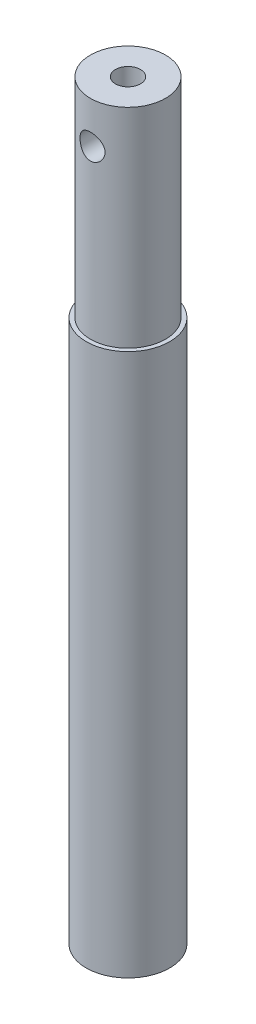
ISO-10303-21;
HEADER;
FILE_DESCRIPTION(('STEP AP214'),'2;1');
FILE_NAME('part.step','',(''),(''),'','','');
FILE_SCHEMA(('AUTOMOTIVE_DESIGN { 1 0 10303 214 1 1 1 1 }'));
ENDSEC;
DATA;
#1=APPLICATION_CONTEXT('core data for automotive mechanical design processes');
#2=APPLICATION_PROTOCOL_DEFINITION('international standard','automotive_design',2000,#1);
#3=PRODUCT_CONTEXT('',#1,'mechanical');
#4=PRODUCT('Part','Part','',(#3));
#5=PRODUCT_RELATED_PRODUCT_CATEGORY('part','',(#4));
#6=PRODUCT_DEFINITION_FORMATION('','',#4);
#7=PRODUCT_DEFINITION_CONTEXT('part definition',#1,'design');
#8=PRODUCT_DEFINITION('design','',#6,#7);
#9=PRODUCT_DEFINITION_SHAPE('','',#8);
#10=(LENGTH_UNIT() NAMED_UNIT(*) SI_UNIT(.MILLI.,.METRE.));
#11=(NAMED_UNIT(*) PLANE_ANGLE_UNIT() SI_UNIT($,.RADIAN.));
#12=(NAMED_UNIT(*) SI_UNIT($,.STERADIAN.) SOLID_ANGLE_UNIT());
#13=UNCERTAINTY_MEASURE_WITH_UNIT(LENGTH_MEASURE(1.E-05),#10,'distance_accuracy_value','');
#14=(GEOMETRIC_REPRESENTATION_CONTEXT(3) GLOBAL_UNCERTAINTY_ASSIGNED_CONTEXT((#13)) GLOBAL_UNIT_ASSIGNED_CONTEXT((#10,
#11,#12)) REPRESENTATION_CONTEXT('',''));
#15=CARTESIAN_POINT('',(0.,0.,0.));
#16=DIRECTION('',(0.,0.,1.));
#17=DIRECTION('',(1.,0.,0.));
#18=AXIS2_PLACEMENT_3D('',#15,#16,#17);
#19=CARTESIAN_POINT('',(0.,90.,0.));
#20=DIRECTION('',(0.,-1.,0.));
#21=DIRECTION('',(0.,0.,-1.));
#22=AXIS2_PLACEMENT_3D('',#19,#20,#21);
#23=CYLINDRICAL_SURFACE('',#22,1.5);
#24=CARTESIAN_POINT('',(0.,85.,0.));
#25=DIRECTION('',(0.,-0.707106781186547,0.707106781186547));
#26=DIRECTION('',(0.,-0.707106781186547,-0.707106781186547));
#27=AXIS2_PLACEMENT_3D('',#24,#25,#26);
#28=ELLIPSE('',#27,2.12132034355964,1.5);
#29=CARTESIAN_POINT('',(-1.5,85.,0.));
#30=VERTEX_POINT('',#29);
#31=CARTESIAN_POINT('',(1.5,85.,0.));
#32=VERTEX_POINT('',#31);
#33=EDGE_CURVE('E11',#30,#32,#28,.F.);
#34=ORIENTED_EDGE('',*,*,#33,.F.);
#35=CARTESIAN_POINT('',(0.,85.,0.));
#36=DIRECTION('',(0.,-0.707106781186547,-0.707106781186547));
#37=DIRECTION('',(0.,-0.707106781186547,0.707106781186547));
#38=AXIS2_PLACEMENT_3D('',#35,#36,#37);
#39=ELLIPSE('',#38,2.12132034355964,1.5);
#40=EDGE_CURVE('E48',#32,#30,#39,.F.);
#41=ORIENTED_EDGE('',*,*,#40,.F.);
#42=EDGE_LOOP('',(#34,#41));
#43=FACE_BOUND('',#42,.T.);
#44=CARTESIAN_POINT('',(0.,90.,0.));
#45=DIRECTION('',(0.,1.,0.));
#46=DIRECTION('',(0.,0.,1.));
#47=AXIS2_PLACEMENT_3D('',#44,#45,#46);
#48=CIRCLE('',#47,1.5);
#49=CARTESIAN_POINT('',(0.,90.,1.5));
#50=VERTEX_POINT('',#49);
#51=EDGE_CURVE('E85',#50,#50,#48,.T.);
#52=ORIENTED_EDGE('',*,*,#51,.T.);
#53=EDGE_LOOP('',(#52));
#54=FACE_BOUND('',#53,.T.);
#55=ADVANCED_FACE('F34',(#43,#54),#23,.F.);
#56=CARTESIAN_POINT('',(0.,65.,0.));
#57=DIRECTION('',(0.,1.,0.));
#58=DIRECTION('',(0.,0.,1.));
#59=AXIS2_PLACEMENT_3D('',#56,#57,#58);
#60=PLANE('',#59);
#61=CARTESIAN_POINT('',(0.,65.,0.));
#62=DIRECTION('',(0.,1.,0.));
#63=DIRECTION('',(0.,0.,1.));
#64=AXIS2_PLACEMENT_3D('',#61,#62,#63);
#65=CIRCLE('',#64,4.5);
#66=CARTESIAN_POINT('',(0.,65.,4.5));
#67=VERTEX_POINT('',#66);
#68=EDGE_CURVE('E62',#67,#67,#65,.T.);
#69=ORIENTED_EDGE('',*,*,#68,.F.);
#70=EDGE_LOOP('',(#69));
#71=FACE_BOUND('',#70,.T.);
#72=CARTESIAN_POINT('',(0.,65.,0.));
#73=DIRECTION('',(0.,1.,0.));
#74=DIRECTION('',(0.,0.,1.));
#75=AXIS2_PLACEMENT_3D('',#72,#73,#74);
#76=CIRCLE('',#75,5.);
#77=CARTESIAN_POINT('',(0.,65.,5.));
#78=VERTEX_POINT('',#77);
#79=EDGE_CURVE('E71',#78,#78,#76,.T.);
#80=ORIENTED_EDGE('',*,*,#79,.T.);
#81=EDGE_LOOP('',(#80));
#82=FACE_BOUND('',#81,.T.);
#83=ADVANCED_FACE('F127',(#71,#82),#60,.T.);
#84=CARTESIAN_POINT('',(0.,0.,0.));
#85=DIRECTION('',(0.,1.,0.));
#86=DIRECTION('',(0.,0.,1.));
#87=AXIS2_PLACEMENT_3D('',#84,#85,#86);
#88=PLANE('',#87);
#89=CARTESIAN_POINT('',(0.,0.,0.));
#90=DIRECTION('',(0.,1.,0.));
#91=DIRECTION('',(0.,0.,1.));
#92=AXIS2_PLACEMENT_3D('',#89,#90,#91);
#93=CIRCLE('',#92,5.);
#94=CARTESIAN_POINT('',(0.,0.,5.));
#95=VERTEX_POINT('',#94);
#96=EDGE_CURVE('E68',#95,#95,#93,.T.);
#97=ORIENTED_EDGE('',*,*,#96,.F.);
#98=EDGE_LOOP('',(#97));
#99=FACE_BOUND('',#98,.T.);
#100=CARTESIAN_POINT('',(0.,0.,0.));
#101=DIRECTION('',(0.,1.,0.));
#102=DIRECTION('',(0.,0.,1.));
#103=AXIS2_PLACEMENT_3D('',#100,#101,#102);
#104=CIRCLE('',#103,2.5);
#105=CARTESIAN_POINT('',(0.,0.,2.5));
#106=VERTEX_POINT('',#105);
#107=EDGE_CURVE('E72',#106,#106,#104,.T.);
#108=ORIENTED_EDGE('',*,*,#107,.T.);
#109=EDGE_LOOP('',(#108));
#110=FACE_BOUND('',#109,.T.);
#111=ADVANCED_FACE('F131',(#99,#110),#88,.F.);
#112=CARTESIAN_POINT('',(0.,65.,0.));
#113=DIRECTION('',(0.,-1.,0.));
#114=DIRECTION('',(0.,0.,-1.));
#115=AXIS2_PLACEMENT_3D('',#112,#113,#114);
#116=CYLINDRICAL_SURFACE('',#115,5.);
#117=ORIENTED_EDGE('',*,*,#79,.F.);
#118=EDGE_LOOP('',(#117));
#119=FACE_BOUND('',#118,.T.);
#120=ORIENTED_EDGE('',*,*,#96,.T.);
#121=EDGE_LOOP('',(#120));
#122=FACE_BOUND('',#121,.T.);
#123=ADVANCED_FACE('F36',(#119,#122),#116,.T.);
#124=CARTESIAN_POINT('',(0.,65.,0.));
#125=DIRECTION('',(0.,-1.,0.));
#126=DIRECTION('',(0.,0.,-1.));
#127=AXIS2_PLACEMENT_3D('',#124,#125,#126);
#128=CYLINDRICAL_SURFACE('',#127,2.5);
#129=CARTESIAN_POINT('',(0.,65.,0.));
#130=DIRECTION('',(0.,1.,0.));
#131=DIRECTION('',(0.,0.,1.));
#132=AXIS2_PLACEMENT_3D('',#129,#130,#131);
#133=CIRCLE('',#132,2.5);
#134=CARTESIAN_POINT('',(0.,65.,2.5));
#135=VERTEX_POINT('',#134);
#136=EDGE_CURVE('E77',#135,#135,#133,.T.);
#137=ORIENTED_EDGE('',*,*,#136,.T.);
#138=EDGE_LOOP('',(#137));
#139=FACE_BOUND('',#138,.T.);
#140=ORIENTED_EDGE('',*,*,#107,.F.);
#141=EDGE_LOOP('',(#140));
#142=FACE_BOUND('',#141,.T.);
#143=ADVANCED_FACE('F116',(#139,#142),#128,.F.);
#144=CARTESIAN_POINT('',(0.,90.,0.));
#145=DIRECTION('',(0.,1.,0.));
#146=DIRECTION('',(0.,0.,1.));
#147=AXIS2_PLACEMENT_3D('',#144,#145,#146);
#148=PLANE('',#147);
#149=CARTESIAN_POINT('',(0.,90.,0.));
#150=DIRECTION('',(0.,1.,0.));
#151=DIRECTION('',(0.,0.,1.));
#152=AXIS2_PLACEMENT_3D('',#149,#150,#151);
#153=CIRCLE('',#152,4.5);
#154=CARTESIAN_POINT('',(0.,90.,4.5));
#155=VERTEX_POINT('',#154);
#156=EDGE_CURVE('E80',#155,#155,#153,.T.);
#157=ORIENTED_EDGE('',*,*,#156,.T.);
#158=EDGE_LOOP('',(#157));
#159=FACE_BOUND('',#158,.T.);
#160=ORIENTED_EDGE('',*,*,#51,.F.);
#161=EDGE_LOOP('',(#160));
#162=FACE_BOUND('',#161,.T.);
#163=ADVANCED_FACE('F113',(#159,#162),#148,.T.);
#164=CARTESIAN_POINT('',(0.,65.,0.));
#165=DIRECTION('',(0.,1.,0.));
#166=DIRECTION('',(0.,0.,1.));
#167=AXIS2_PLACEMENT_3D('',#164,#165,#166);
#168=PLANE('',#167);
#169=ORIENTED_EDGE('',*,*,#136,.F.);
#170=EDGE_LOOP('',(#169));
#171=FACE_BOUND('',#170,.T.);
#172=CARTESIAN_POINT('',(0.,65.,0.));
#173=DIRECTION('',(0.,1.,0.));
#174=DIRECTION('',(0.,0.,1.));
#175=AXIS2_PLACEMENT_3D('',#172,#173,#174);
#176=CIRCLE('',#175,1.5);
#177=CARTESIAN_POINT('',(0.,65.,1.5));
#178=VERTEX_POINT('',#177);
#179=EDGE_CURVE('E86',#178,#178,#176,.T.);
#180=ORIENTED_EDGE('',*,*,#179,.T.);
#181=EDGE_LOOP('',(#180));
#182=FACE_BOUND('',#181,.T.);
#183=ADVANCED_FACE('F115',(#171,#182),#168,.F.);
#184=CARTESIAN_POINT('',(0.,90.,0.));
#185=DIRECTION('',(0.,-1.,0.));
#186=DIRECTION('',(0.,0.,-1.));
#187=AXIS2_PLACEMENT_3D('',#184,#185,#186);
#188=CYLINDRICAL_SURFACE('',#187,4.5);
#189=CARTESIAN_POINT('',(0.,86.5,-4.5));
#190=CARTESIAN_POINT('',(-0.0818450443300849,86.5000003805975,-4.50000022951416));
#191=CARTESIAN_POINT('',(-0.163687791807825,86.4932796008092,-4.49774654261317));
#192=CARTESIAN_POINT('',(-0.324962641309459,86.4666563367742,-4.48897815304921));
#193=CARTESIAN_POINT('',(-0.404394492178228,86.4467524840766,-4.48246300803229));
#194=CARTESIAN_POINT('',(-0.558499184252665,86.3945211349239,-4.46587961859664));
#195=CARTESIAN_POINT('',(-0.633179738829052,86.3622144063111,-4.4558173159628));
#196=CARTESIAN_POINT('',(-0.776062405207986,86.2861882407425,-4.43316668576013));
#197=CARTESIAN_POINT('',(-0.844263235438057,86.2424665524961,-4.42057786001667));
#198=CARTESIAN_POINT('',(-0.974612512533398,86.1432612927119,-4.39371141664508));
#199=CARTESIAN_POINT('',(-1.03650555044746,86.0874531486093,-4.37939334695677));
#200=CARTESIAN_POINT('',(-1.15024903905312,85.9663492679402,-4.35090472174682));
#201=CARTESIAN_POINT('',(-1.20209727823419,85.9010514476072,-4.33673419935824));
#202=CARTESIAN_POINT('',(-1.29573741334179,85.7605223272053,-4.30969998715911));
#203=CARTESIAN_POINT('',(-1.33719728733155,85.6850593904018,-4.29688558913532));
#204=CARTESIAN_POINT('',(-1.40672831081659,85.5277358583122,-4.27462958127902));
#205=CARTESIAN_POINT('',(-1.43480354608015,85.4458772242559,-4.26518694241118));
#206=CARTESIAN_POINT('',(-1.47581019226375,85.2809901677549,-4.25116954904066));
#207=CARTESIAN_POINT('',(-1.48922017240766,85.1980941872664,-4.24644143654417));
#208=CARTESIAN_POINT('',(-1.50201168500172,85.0311043687662,-4.24193484944261));
#209=CARTESIAN_POINT('',(-1.50139755240708,84.9470109089362,-4.24215484534095));
#210=CARTESIAN_POINT('',(-1.48652985555513,84.784095054334,-4.2473852251227));
#211=CARTESIAN_POINT('',(-1.47290086975049,84.7052073956215,-4.25217623801299));
#212=CARTESIAN_POINT('',(-1.43340924427413,84.5509098705897,-4.26564986586826));
#213=CARTESIAN_POINT('',(-1.40754513988781,84.4755004218474,-4.27433294676161));
#214=CARTESIAN_POINT('',(-1.34390858709032,84.3288808756128,-4.29476866696873));
#215=CARTESIAN_POINT('',(-1.3059510730609,84.2577579617957,-4.30656848689676));
#216=CARTESIAN_POINT('',(-1.21933365945471,84.1226936375804,-4.3318883786359));
#217=CARTESIAN_POINT('',(-1.17067066854601,84.0587543095999,-4.34540894685695));
#218=CARTESIAN_POINT('',(-1.06102399902335,83.9363626027588,-4.37350993751611));
#219=CARTESIAN_POINT('',(-0.999529725114464,83.8783709582364,-4.38810884032264));
#220=CARTESIAN_POINT('',(-0.867509354955092,83.7734031000049,-4.41610407580555));
#221=CARTESIAN_POINT('',(-0.796982393491218,83.7264279427533,-4.42950029307101));
#222=CARTESIAN_POINT('',(-0.6479214195694,83.6444555496474,-4.4537566190669));
#223=CARTESIAN_POINT('',(-0.569314914624505,83.6095817629889,-4.46459025012059));
#224=CARTESIAN_POINT('',(-0.406903625046763,83.5536952390664,-4.48230850716652));
#225=CARTESIAN_POINT('',(-0.323100657232433,83.5326776868648,-4.48919450482319));
#226=CARTESIAN_POINT('',(-0.156575744293958,83.5059165009664,-4.49801440607161));
#227=CARTESIAN_POINT('',(-0.0739643997972714,83.4995502862409,-4.50015002750592));
#228=CARTESIAN_POINT('',(0.091162604940355,83.5004990103977,-4.49983354042241));
#229=CARTESIAN_POINT('',(0.173678278979475,83.5078116399698,-4.49738220629043));
#230=CARTESIAN_POINT('',(0.333779799456383,83.5354178616039,-4.48830037075656));
#231=CARTESIAN_POINT('',(0.411439210252265,83.5553293090742,-4.48179298066788));
#232=CARTESIAN_POINT('',(0.56228393786936,83.6070901667001,-4.46537770245105));
#233=CARTESIAN_POINT('',(0.635468682762909,83.6389410992017,-4.45546938070013));
#234=CARTESIAN_POINT('',(0.777432444589911,83.7146056477612,-4.43293396930935));
#235=CARTESIAN_POINT('',(0.846044938825723,83.7587118899247,-4.42024222133679));
#236=CARTESIAN_POINT('',(0.975097245203384,83.8572912250202,-4.39357880874393));
#237=CARTESIAN_POINT('',(1.03553455169337,83.9117674840476,-4.37960675390741));
#238=CARTESIAN_POINT('',(1.14937876170945,84.0324681265099,-4.35115271970667));
#239=CARTESIAN_POINT('',(1.20234145386866,84.0991138403903,-4.33667641631142));
#240=CARTESIAN_POINT('',(1.29638628348537,84.2406573517163,-4.30949959942063));
#241=CARTESIAN_POINT('',(1.33746832189652,84.3155552179511,-4.29679910073003));
#242=CARTESIAN_POINT('',(1.40639539562454,84.4715095229348,-4.27473587687075));
#243=CARTESIAN_POINT('',(1.43426719824753,84.5525531187531,-4.26536641189468));
#244=CARTESIAN_POINT('',(1.47584200013904,84.7185679750662,-4.25116248459674));
#245=CARTESIAN_POINT('',(1.48955138243091,84.8035374481065,-4.24632597935459));
#246=CARTESIAN_POINT('',(1.50191442371601,84.9702956440614,-4.24196788311266));
#247=CARTESIAN_POINT('',(1.5013053859626,85.0520235104302,-4.24218600386123));
#248=CARTESIAN_POINT('',(1.48686344017304,85.2141476123831,-4.24726904735801));
#249=CARTESIAN_POINT('',(1.47303131918788,85.2945439269326,-4.25213369354042));
#250=CARTESIAN_POINT('',(1.43305771969401,85.4502034945037,-4.26576786457338));
#251=CARTESIAN_POINT('',(1.40715501902327,85.5255352375067,-4.27446147033716));
#252=CARTESIAN_POINT('',(1.34396904863962,85.6708411104074,-4.29474598227703));
#253=CARTESIAN_POINT('',(1.30668325283071,85.740814046782,-4.3063375314509));
#254=CARTESIAN_POINT('',(1.21989103887514,85.8767255048844,-4.33174243839069));
#255=CARTESIAN_POINT('',(1.16992236414687,85.9423547528476,-4.34563067463206));
#256=CARTESIAN_POINT('',(1.05996432470347,86.0645347200763,-4.37375034424879));
#257=CARTESIAN_POINT('',(0.999972126677225,86.1210828635321,-4.38798187368558));
#258=CARTESIAN_POINT('',(0.868862335381034,86.2257166184338,-4.41585045788316));
#259=CARTESIAN_POINT('',(0.797402270249593,86.2733865216265,-4.42944272701885));
#260=CARTESIAN_POINT('',(0.647036036109934,86.355985643276,-4.45388986758918));
#261=CARTESIAN_POINT('',(0.56813177719852,86.3909181188831,-4.46474543861895));
#262=CARTESIAN_POINT('',(0.408740470801462,86.445582448733,-4.48208272602813));
#263=CARTESIAN_POINT('',(0.328481636514612,86.4659236993951,-4.48873818633784));
#264=CARTESIAN_POINT('',(0.165480624015371,86.4931304210157,-4.49769610596333));
#265=CARTESIAN_POINT('',(0.0827391383531197,86.4999996152448,-4.49999976797857));
#266=CARTESIAN_POINT('',(0.,86.5,-4.5));
#267=B_SPLINE_CURVE_WITH_KNOTS('',3,(#189,#190,#191,#192,#193,#194,#195,#196,#197,#198,#199,
#200,#201,#202,#203,#204,#205,#206,#207,#208,#209,#210,#211,#212,#213,#214,#215,#216,#217,#218,
#219,#220,#221,#222,#223,#224,#225,#226,#227,#228,#229,#230,#231,#232,#233,#234,#235,#236,#237,
#238,#239,#240,#241,#242,#243,#244,#245,#246,#247,#248,#249,#250,#251,#252,#253,#254,#255,#256,
#257,#258,#259,#260,#261,#262,#263,#264,#265,#266),.UNSPECIFIED.,.T.,.F.,(4,2,2,2,2,2,2,2,2,2,2,
2,2,2,2,2,2,2,2,2,2,2,2,2,2,2,2,2,2,2,2,2,2,2,2,2,2,2,4),(0.,0.245230659039017,
0.490486777901282,0.735334009305414,0.980229566698647,1.23277026424133,1.48536649931296,
1.74522577235206,2.0050056703925,2.25602888612762,2.50697450981229,2.74645239826921,
2.98595896283223,3.22932256732696,3.47275653837312,3.72889958717052,3.98506718949928,
4.24377608475536,4.50239503315813,4.74980374762755,4.99717069746265,5.2373723696732,
5.47760467926156,5.72415599765605,5.97078271232838,6.22861534321129,6.48645012352496,
6.74376020740156,7.00095427058762,7.24493499096388,7.48890119027065,7.72823380620628,
7.96761957263968,8.21745100037707,8.46735316685669,8.72699491252652,8.98657021728685,
9.23454837560721,9.4824579905721),.UNSPECIFIED.);
#268=CARTESIAN_POINT('',(0.,86.5,-4.5));
#269=VERTEX_POINT('',#268);
#270=EDGE_CURVE('E89',#269,#269,#267,.T.);
#271=ORIENTED_EDGE('',*,*,#270,.T.);
#272=EDGE_LOOP('',(#271));
#273=FACE_BOUND('',#272,.T.);
#274=CARTESIAN_POINT('',(1.5,85.,4.24264068711928));
#275=CARTESIAN_POINT('',(1.50000038692157,84.9182977377459,4.24264041795651));
#276=CARTESIAN_POINT('',(1.49330217552829,84.8365978002646,4.24502653936286));
#277=CARTESIAN_POINT('',(1.46677669753322,84.6756183685086,4.25426361121882));
#278=CARTESIAN_POINT('',(1.4469472682526,84.5963392751913,4.26111529713283));
#279=CARTESIAN_POINT('',(1.39493322852736,84.4425596605041,4.27842305533187));
#280=CARTESIAN_POINT('',(1.36277283210487,84.3680501058359,4.28887205956982));
#281=CARTESIAN_POINT('',(1.28709244266208,84.2254599271781,4.31218683015487));
#282=CARTESIAN_POINT('',(1.24356994329028,84.1573807261696,4.32505312955418));
#283=CARTESIAN_POINT('',(1.14457671966432,84.0269200564925,4.3523173411121));
#284=CARTESIAN_POINT('',(1.08873651206689,83.9648268569924,4.36675342266966));
#285=CARTESIAN_POINT('',(0.967481500821601,83.850689798163,4.39520797201504));
#286=CARTESIAN_POINT('',(0.902065162578571,83.7986475526264,4.40922637243442));
#287=CARTESIAN_POINT('',(0.761406761947523,83.7047816540056,4.43570800382698));
#288=CARTESIAN_POINT('',(0.685952866836796,83.6632600440731,4.44812111552408));
#289=CARTESIAN_POINT('',(0.528646834481221,83.5936126223087,4.46954380156474));
#290=CARTESIAN_POINT('',(0.44679642853083,83.5654832002346,4.47855429304502));
#291=CARTESIAN_POINT('',(0.282043226150254,83.5243962180514,4.4918861314786));
#292=CARTESIAN_POINT('',(0.199276132279462,83.5109448306145,4.49635972166341));
#293=CARTESIAN_POINT('',(0.0325468122361427,83.498025559959,4.5006541232737));
#294=CARTESIAN_POINT('',(-0.0514151003158347,83.4985540725214,4.50047613394335));
#295=CARTESIAN_POINT('',(-0.214655272790723,83.513266381849,4.49559059428104));
#296=CARTESIAN_POINT('',(-0.293988072887498,83.5269137927118,4.49106097132703));
#297=CARTESIAN_POINT('',(-0.449165158233238,83.5665894714707,4.47820451009571));
#298=CARTESIAN_POINT('',(-0.52500920666876,83.5926185784696,4.46987741446672));
#299=CARTESIAN_POINT('',(-0.672228712263017,83.6566319759592,4.45013505439938));
#300=CARTESIAN_POINT('',(-0.743532331453492,83.6947689078202,4.43868063786404));
#301=CARTESIAN_POINT('',(-0.878886488290749,83.7817895581726,4.41387589557997));
#302=CARTESIAN_POINT('',(-0.94293500157715,83.8306762649899,4.40052504300777));
#303=CARTESIAN_POINT('',(-1.06515129982786,83.9405115901911,4.37259287776335));
#304=CARTESIAN_POINT('',(-1.12290023560133,84.0019197367682,4.35798322759));
#305=CARTESIAN_POINT('',(-1.22741588939384,84.133673088584,4.32971002867667));
#306=CARTESIAN_POINT('',(-1.27418091490951,84.2040196685698,4.31604662597175));
#307=CARTESIAN_POINT('',(-1.3559811825641,84.3529804384231,4.29105787703296));
#308=CARTESIAN_POINT('',(-1.39083969547657,84.4316981970517,4.27976864008232));
#309=CARTESIAN_POINT('',(-1.44666478994926,84.5943570913994,4.26122476317448));
#310=CARTESIAN_POINT('',(-1.46763719363329,84.6782960218327,4.25396843251835));
#311=CARTESIAN_POINT('',(-1.49424192313571,84.8449575331009,4.24469454453105));
#312=CARTESIAN_POINT('',(-1.50052364325862,84.9275641371186,4.24245540472709));
#313=CARTESIAN_POINT('',(-1.49940815836741,85.0926642236755,4.242850080942));
#314=CARTESIAN_POINT('',(-1.49201343784089,85.1751577240371,4.24548301189152));
#315=CARTESIAN_POINT('',(-1.46433847732775,85.3347354485667,4.25510427134068));
#316=CARTESIAN_POINT('',(-1.44450959097084,85.4119081452259,4.2619398816089));
#317=CARTESIAN_POINT('',(-1.3930707938409,85.561815409359,4.27902830506905));
#318=CARTESIAN_POINT('',(-1.36145879454519,85.6345491873862,4.2892817240236));
#319=CARTESIAN_POINT('',(-1.28621151110836,85.7760706312704,4.31245316393576));
#320=CARTESIAN_POINT('',(-1.24222667753774,85.8446599639627,4.32544538498414));
#321=CARTESIAN_POINT('',(-1.14387844583636,85.9737190785756,4.35248653096475));
#322=CARTESIAN_POINT('',(-1.08951198824818,86.0341864579918,4.36653576665699));
#323=CARTESIAN_POINT('',(-0.968837558850483,86.148291976136,4.39492557956765));
#324=CARTESIAN_POINT('',(-0.902080905819975,86.2014615850283,4.40924765366843));
#325=CARTESIAN_POINT('',(-0.760240937100387,86.2958742135221,4.43590277419665));
#326=CARTESIAN_POINT('',(-0.685157917296835,86.3371176567436,4.44823589126543));
#327=CARTESIAN_POINT('',(-0.529169793648454,86.4061301572926,4.46946608715904));
#328=CARTESIAN_POINT('',(-0.448306684981804,86.4339869157221,4.47838545006796));
#329=CARTESIAN_POINT('',(-0.282687698769031,86.4755916130901,4.49187916256662));
#330=CARTESIAN_POINT('',(-0.19793323793084,86.4893446448207,4.49645508051028));
#331=CARTESIAN_POINT('',(-0.0312230037900659,86.5018931164085,4.50062794854384));
#332=CARTESIAN_POINT('',(0.0506770858800229,86.5013611808986,4.50044880134159));
#333=CARTESIAN_POINT('',(0.213166717500256,86.4870140377804,4.49568294779097));
#334=CARTESIAN_POINT('',(0.293756365228581,86.4731999077708,4.49109659900363));
#335=CARTESIAN_POINT('',(0.450063179148085,86.4331266481361,4.47811372431619));
#336=CARTESIAN_POINT('',(0.525837406369182,86.4070686769706,4.46977887541723));
#337=CARTESIAN_POINT('',(0.671967526409691,86.3434337033543,4.45015741056743));
#338=CARTESIAN_POINT('',(0.742322436213646,86.3058546172045,4.43887026072025));
#339=CARTESIAN_POINT('',(0.878451024463172,86.218645731847,4.41398803241821));
#340=CARTESIAN_POINT('',(0.943959377336402,86.1686219719275,4.4003230873789));
#341=CARTESIAN_POINT('',(1.06587153940863,86.0586139132657,4.37239483187819));
#342=CARTESIAN_POINT('',(1.12227243243688,85.9986264366059,4.35813133159646));
#343=CARTESIAN_POINT('',(1.22661271324967,85.8675859666196,4.32994919738397));
#344=CARTESIAN_POINT('',(1.27413444899685,85.796191733535,4.31606591982946));
#345=CARTESIAN_POINT('',(1.35647151495167,85.6459983596458,4.29090289984523));
#346=CARTESIAN_POINT('',(1.39129016522921,85.5672011604555,4.27962247741874));
#347=CARTESIAN_POINT('',(1.44576574230625,85.4080572639765,4.26152001309772));
#348=CARTESIAN_POINT('',(1.46603686372428,85.3279416047119,4.25451949285773));
#349=CARTESIAN_POINT('',(1.4931514802239,85.1652159242999,4.24508075309277));
#350=CARTESIAN_POINT('',(1.49999960879489,85.0826067738839,4.24264095926191));
#351=CARTESIAN_POINT('',(1.5,85.,4.24264068711928));
#352=B_SPLINE_CURVE_WITH_KNOTS('',3,(#274,#275,#276,#277,#278,#279,#280,#281,#282,#283,#284,
#285,#286,#287,#288,#289,#290,#291,#292,#293,#294,#295,#296,#297,#298,#299,#300,#301,#302,#303,
#304,#305,#306,#307,#308,#309,#310,#311,#312,#313,#314,#315,#316,#317,#318,#319,#320,#321,#322,
#323,#324,#325,#326,#327,#328,#329,#330,#331,#332,#333,#334,#335,#336,#337,#338,#339,#340,#341,
#342,#343,#344,#345,#346,#347,#348,#349,#350,#351),.UNSPECIFIED.,.T.,.F.,(4,2,2,2,2,2,2,2,2,2,2,
2,2,2,2,2,2,2,2,2,2,2,2,2,2,2,2,2,2,2,2,2,2,2,2,2,2,2,4),(0.,0.244800877199017,
0.489642082522738,0.734004941251242,0.978421749278151,1.23152006141351,1.48465897757981,
1.74440259215485,2.00407614580182,2.25471478147401,2.50528879953491,2.74603507238353,
2.98679766283855,3.23072482290502,3.47471987811033,3.73020261545876,3.98572469418159,
4.24488959763006,4.50394577031476,4.75131437043211,4.99863803752402,5.23746593649715,
5.47633618716969,5.72278286600123,5.96930228489744,6.22768212253191,6.48605278132849,
6.74270686782829,6.99926824502787,7.24377127013005,7.48825446011223,7.72885434057197,
7.96949776141415,8.21903279277501,8.46864756645499,8.72803354100768,8.98735167396851,
9.23494818240589,9.48245920782248),.UNSPECIFIED.);
#353=CARTESIAN_POINT('',(1.5,85.,4.24264068711928));
#354=VERTEX_POINT('',#353);
#355=EDGE_CURVE('E99',#354,#354,#352,.T.);
#356=ORIENTED_EDGE('',*,*,#355,.T.);
#357=EDGE_LOOP('',(#356));
#358=FACE_BOUND('',#357,.T.);
#359=ORIENTED_EDGE('',*,*,#156,.F.);
#360=EDGE_LOOP('',(#359));
#361=FACE_BOUND('',#360,.T.);
#362=ORIENTED_EDGE('',*,*,#68,.T.);
#363=EDGE_LOOP('',(#362));
#364=FACE_BOUND('',#363,.T.);
#365=ADVANCED_FACE('F103',(#273,#358,#361,#364),#188,.T.);
#366=CARTESIAN_POINT('',(0.,85.,0.));
#367=DIRECTION('',(0.,-0.707106781186547,0.707106781186547));
#368=DIRECTION('',(0.,-0.707106781186547,-0.707106781186547));
#369=AXIS2_PLACEMENT_3D('',#366,#367,#368);
#370=ELLIPSE('',#369,2.12132034355964,1.5);
#371=EDGE_CURVE('E42',#30,#32,#370,.T.);
#372=ORIENTED_EDGE('',*,*,#371,.F.);
#373=CARTESIAN_POINT('',(0.,85.,0.));
#374=DIRECTION('',(0.,-0.707106781186547,-0.707106781186547));
#375=DIRECTION('',(0.,-0.707106781186547,0.707106781186547));
#376=AXIS2_PLACEMENT_3D('',#373,#374,#375);
#377=ELLIPSE('',#376,2.12132034355964,1.5);
#378=EDGE_CURVE('E53',#32,#30,#377,.T.);
#379=ORIENTED_EDGE('',*,*,#378,.F.);
#380=EDGE_LOOP('',(#372,#379));
#381=FACE_BOUND('',#380,.T.);
#382=ORIENTED_EDGE('',*,*,#179,.F.);
#383=EDGE_LOOP('',(#382));
#384=FACE_BOUND('',#383,.T.);
#385=ADVANCED_FACE('F65',(#381,#384),#23,.F.);
#386=CARTESIAN_POINT('',(0.,85.,-32.5));
#387=DIRECTION('',(0.,0.,1.));
#388=DIRECTION('',(1.,0.,0.));
#389=AXIS2_PLACEMENT_3D('',#386,#387,#388);
#390=CYLINDRICAL_SURFACE('',#389,1.5);
#391=ORIENTED_EDGE('',*,*,#371,.T.);
#392=ORIENTED_EDGE('',*,*,#40,.T.);
#393=EDGE_LOOP('',(#391,#392));
#394=FACE_BOUND('',#393,.T.);
#395=ORIENTED_EDGE('',*,*,#270,.F.);
#396=EDGE_LOOP('',(#395));
#397=FACE_BOUND('',#396,.T.);
#398=ADVANCED_FACE('F60',(#394,#397),#390,.F.);
#399=ORIENTED_EDGE('',*,*,#33,.T.);
#400=ORIENTED_EDGE('',*,*,#378,.T.);
#401=EDGE_LOOP('',(#399,#400));
#402=FACE_BOUND('',#401,.T.);
#403=ORIENTED_EDGE('',*,*,#355,.F.);
#404=EDGE_LOOP('',(#403));
#405=FACE_BOUND('',#404,.T.);
#406=ADVANCED_FACE('F54',(#402,#405),#390,.F.);
#407=CLOSED_SHELL('',(#55,#83,#111,#123,#143,#163,#183,#365,#385,#398,#406));
#408=MANIFOLD_SOLID_BREP('B2',#407);
#409=ADVANCED_BREP_SHAPE_REPRESENTATION('',(#18,#408),#14);
#410=SHAPE_DEFINITION_REPRESENTATION(#9,#409);
ENDSEC;
END-ISO-10303-21;
